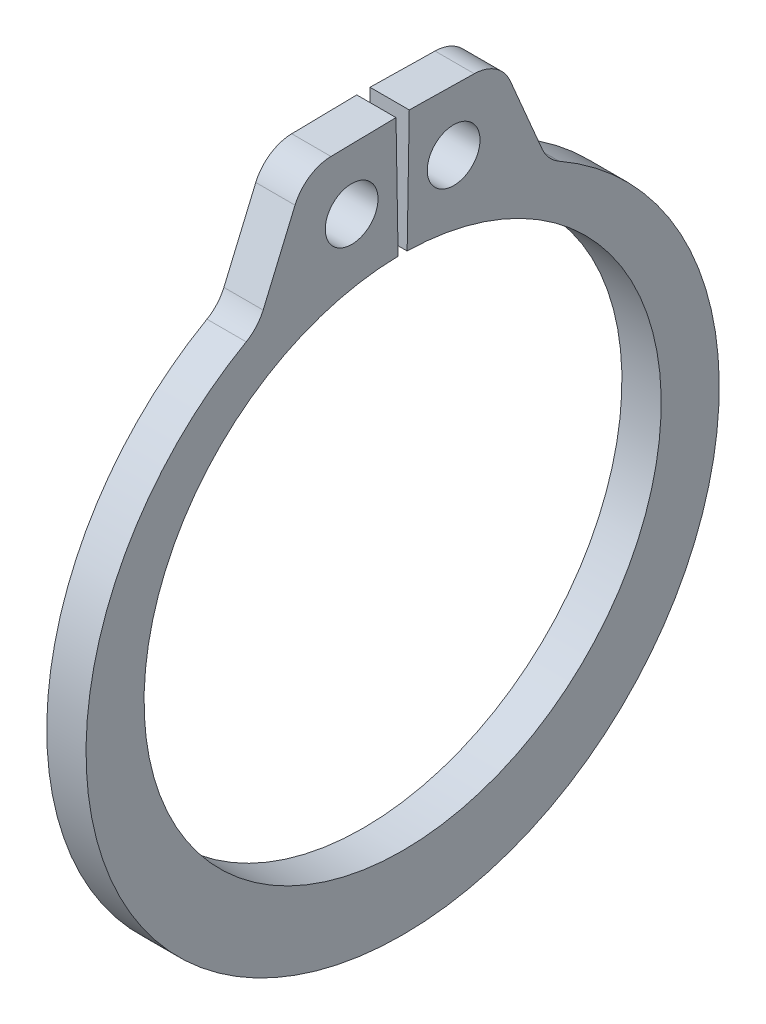
ISO-10303-21;
HEADER;
FILE_DESCRIPTION(('STEP AP214'),'2;1');
FILE_NAME('part.step','',(''),(''),'','','');
FILE_SCHEMA(('AUTOMOTIVE_DESIGN { 1 0 10303 214 1 1 1 1 }'));
ENDSEC;
DATA;
#1=APPLICATION_CONTEXT('core data for automotive mechanical design processes');
#2=APPLICATION_PROTOCOL_DEFINITION('international standard','automotive_design',2000,#1);
#3=PRODUCT_CONTEXT('',#1,'mechanical');
#4=PRODUCT('Part','Part','',(#3));
#5=PRODUCT_RELATED_PRODUCT_CATEGORY('part','',(#4));
#6=PRODUCT_DEFINITION_FORMATION('','',#4);
#7=PRODUCT_DEFINITION_CONTEXT('part definition',#1,'design');
#8=PRODUCT_DEFINITION('design','',#6,#7);
#9=PRODUCT_DEFINITION_SHAPE('','',#8);
#10=(LENGTH_UNIT() NAMED_UNIT(*) SI_UNIT(.MILLI.,.METRE.));
#11=(NAMED_UNIT(*) PLANE_ANGLE_UNIT() SI_UNIT($,.RADIAN.));
#12=(NAMED_UNIT(*) SI_UNIT($,.STERADIAN.) SOLID_ANGLE_UNIT());
#13=UNCERTAINTY_MEASURE_WITH_UNIT(LENGTH_MEASURE(1.E-05),#10,'distance_accuracy_value','');
#14=(GEOMETRIC_REPRESENTATION_CONTEXT(3) GLOBAL_UNCERTAINTY_ASSIGNED_CONTEXT((#13)) GLOBAL_UNIT_ASSIGNED_CONTEXT((#10,
#11,#12)) REPRESENTATION_CONTEXT('',''));
#15=CARTESIAN_POINT('',(0.,0.,0.));
#16=DIRECTION('',(0.,0.,1.));
#17=DIRECTION('',(1.,0.,0.));
#18=AXIS2_PLACEMENT_3D('',#15,#16,#17);
#19=CARTESIAN_POINT('',(0.4445,0.,0.));
#20=DIRECTION('',(1.,0.,0.));
#21=DIRECTION('',(0.,0.,-1.));
#22=AXIS2_PLACEMENT_3D('',#19,#20,#21);
#23=PLANE('',#22);
#24=CARTESIAN_POINT('',(0.4445,7.20724610900658,1.15465964864513));
#25=DIRECTION('',(1.,0.,0.));
#26=DIRECTION('',(0.,0.,-1.));
#27=AXIS2_PLACEMENT_3D('',#24,#25,#26);
#28=CIRCLE('',#27,0.5969);
#29=CARTESIAN_POINT('',(0.4445,7.20724610900658,0.557759648645128));
#30=VERTEX_POINT('',#29);
#31=EDGE_CURVE('E172',#30,#30,#28,.T.);
#32=ORIENTED_EDGE('',*,*,#31,.F.);
#33=EDGE_LOOP('',(#32));
#34=FACE_BOUND('',#33,.T.);
#35=DIRECTION('',(0.,-0.01745240643729,0.999847695156391));
#36=VECTOR('',#35,1.);
#37=CARTESIAN_POINT('',(0.4445,8.59659049818515,0.15005404530712));
#38=LINE('',#37,#36);
#39=CARTESIAN_POINT('',(0.4445,8.59659049818515,0.15005404530712));
#40=VERTEX_POINT('',#39);
#41=CARTESIAN_POINT('',(0.4445,8.5708933863481,1.62224059647238));
#42=VERTEX_POINT('',#41);
#43=EDGE_CURVE('E203',#40,#42,#38,.T.);
#44=ORIENTED_EDGE('',*,*,#43,.T.);
#45=CARTESIAN_POINT('',(0.4445,7.66933071962558,1.60650376158788));
#46=DIRECTION('',(1.,0.,0.));
#47=DIRECTION('',(0.,0.,-1.));
#48=AXIS2_PLACEMENT_3D('',#45,#46,#47);
#49=CIRCLE('',#48,0.9017);
#50=CARTESIAN_POINT('',(0.4445,8.02240621636442,2.43620285379096));
#51=VERTEX_POINT('',#50);
#52=EDGE_CURVE('E250',#42,#51,#49,.T.);
#53=ORIENTED_EDGE('',*,*,#52,.T.);
#54=DIRECTION('',(0.,-0.920149819455566,0.391566481910656));
#55=VECTOR('',#54,1.);
#56=CARTESIAN_POINT('',(0.4445,8.56068391718107,2.20714069332188));
#57=LINE('',#56,#55);
#58=CARTESIAN_POINT('',(0.4445,6.32616456625773,3.15803245301383));
#59=VERTEX_POINT('',#58);
#60=EDGE_CURVE('E205',#51,#59,#57,.T.);
#61=ORIENTED_EDGE('',*,*,#60,.T.);
#62=CARTESIAN_POINT('',(0.4445,6.67924006299657,3.98773154521692));
#63=DIRECTION('',(1.,0.,0.));
#64=DIRECTION('',(0.,0.,-1.));
#65=AXIS2_PLACEMENT_3D('',#62,#63,#64);
#66=CIRCLE('',#65,0.9017);
#67=CARTESIAN_POINT('',(0.4445,5.89530863003733,3.54218199868087));
#68=VERTEX_POINT('',#67);
#69=EDGE_CURVE('E258',#59,#68,#66,.F.);
#70=ORIENTED_EDGE('',*,*,#69,.T.);
#71=CARTESIAN_POINT('',(0.4445,-0.337057291142251,0.));
#72=DIRECTION('',(1.,0.,0.));
#73=DIRECTION('',(0.,0.,-1.));
#74=AXIS2_PLACEMENT_3D('',#71,#72,#73);
#75=CIRCLE('',#74,7.16864270885775);
#76=CARTESIAN_POINT('',(0.4445,5.89530863003733,-3.54218199868087));
#77=VERTEX_POINT('',#76);
#78=EDGE_CURVE('E209',#68,#77,#75,.T.);
#79=ORIENTED_EDGE('',*,*,#78,.T.);
#80=CARTESIAN_POINT('',(0.4445,6.67924006299657,-3.98773154521692));
#81=DIRECTION('',(1.,0.,0.));
#82=DIRECTION('',(0.,0.,-1.));
#83=AXIS2_PLACEMENT_3D('',#80,#81,#82);
#84=CIRCLE('',#83,0.9017);
#85=CARTESIAN_POINT('',(0.4445,6.32616456625773,-3.15803245301383));
#86=VERTEX_POINT('',#85);
#87=EDGE_CURVE('E11',#77,#86,#84,.F.);
#88=ORIENTED_EDGE('',*,*,#87,.T.);
#89=DIRECTION('',(0.,0.920149819455566,0.391566481910656));
#90=VECTOR('',#89,1.);
#91=CARTESIAN_POINT('',(0.4445,8.56068391718107,-2.20714069332188));
#92=LINE('',#91,#90);
#93=CARTESIAN_POINT('',(0.4445,8.02240621636442,-2.43620285379096));
#94=VERTEX_POINT('',#93);
#95=EDGE_CURVE('E212',#86,#94,#92,.T.);
#96=ORIENTED_EDGE('',*,*,#95,.T.);
#97=CARTESIAN_POINT('',(0.4445,7.66933071962558,-1.60650376158788));
#98=DIRECTION('',(1.,0.,0.));
#99=DIRECTION('',(0.,0.,-1.));
#100=AXIS2_PLACEMENT_3D('',#97,#98,#99);
#101=CIRCLE('',#100,0.9017);
#102=CARTESIAN_POINT('',(0.4445,8.5708933863481,-1.62224059647238));
#103=VERTEX_POINT('',#102);
#104=EDGE_CURVE('E56',#94,#103,#101,.T.);
#105=ORIENTED_EDGE('',*,*,#104,.T.);
#106=DIRECTION('',(0.,0.01745240643729,0.999847695156391));
#107=VECTOR('',#106,1.);
#108=CARTESIAN_POINT('',(0.4445,8.59659049818515,-0.15005404530712));
#109=LINE('',#108,#107);
#110=CARTESIAN_POINT('',(0.4445,8.59659049818515,-0.15005404530712));
#111=VERTEX_POINT('',#110);
#112=EDGE_CURVE('E215',#103,#111,#109,.T.);
#113=ORIENTED_EDGE('',*,*,#112,.T.);
#114=DIRECTION('',(0.,-0.999847695156391,0.0174524064372833));
#115=VECTOR('',#114,1.);
#116=CARTESIAN_POINT('',(0.4445,5.85380830083213,-0.102178603968365));
#117=LINE('',#116,#115);
#118=CARTESIAN_POINT('',(0.4445,5.85380830083213,-0.102178603968365));
#119=VERTEX_POINT('',#118);
#120=EDGE_CURVE('E217',#111,#119,#117,.T.);
#121=ORIENTED_EDGE('',*,*,#120,.T.);
#122=CARTESIAN_POINT('',(0.4445,0.,0.));
#123=DIRECTION('',(-1.,0.,0.));
#124=DIRECTION('',(0.,0.,-1.));
#125=AXIS2_PLACEMENT_3D('',#122,#123,#124);
#126=CIRCLE('',#125,5.8547);
#127=CARTESIAN_POINT('',(0.4445,5.85380830083213,0.102178603968365));
#128=VERTEX_POINT('',#127);
#129=EDGE_CURVE('E198',#119,#128,#126,.T.);
#130=ORIENTED_EDGE('',*,*,#129,.T.);
#131=DIRECTION('',(0.,0.999847695156391,0.0174524064372833));
#132=VECTOR('',#131,1.);
#133=CARTESIAN_POINT('',(0.4445,5.85380830083213,0.102178603968365));
#134=LINE('',#133,#132);
#135=EDGE_CURVE('E160',#128,#40,#134,.T.);
#136=ORIENTED_EDGE('',*,*,#135,.T.);
#137=EDGE_LOOP('',(#44,#53,#61,#70,#79,#88,#96,#105,#113,#121,#130,#136));
#138=FACE_BOUND('',#137,.T.);
#139=CARTESIAN_POINT('',(0.4445,7.20724610900658,-1.15465964864513));
#140=DIRECTION('',(1.,0.,0.));
#141=DIRECTION('',(0.,0.,-1.));
#142=AXIS2_PLACEMENT_3D('',#139,#140,#141);
#143=CIRCLE('',#142,0.5969);
#144=CARTESIAN_POINT('',(0.4445,7.20724610900658,-1.75155964864513));
#145=VERTEX_POINT('',#144);
#146=EDGE_CURVE('E435',#145,#145,#143,.T.);
#147=ORIENTED_EDGE('',*,*,#146,.F.);
#148=EDGE_LOOP('',(#147));
#149=FACE_BOUND('',#148,.T.);
#150=ADVANCED_FACE('F40',(#34,#138,#149),#23,.T.);
#151=CARTESIAN_POINT('',(-0.4445,0.,0.));
#152=DIRECTION('',(1.,0.,0.));
#153=DIRECTION('',(0.,0.,-1.));
#154=AXIS2_PLACEMENT_3D('',#151,#152,#153);
#155=PLANE('',#154);
#156=CARTESIAN_POINT('',(-0.4445,7.20724610900658,1.15465964864513));
#157=DIRECTION('',(1.,0.,0.));
#158=DIRECTION('',(0.,0.,-1.));
#159=AXIS2_PLACEMENT_3D('',#156,#157,#158);
#160=CIRCLE('',#159,0.5969);
#161=CARTESIAN_POINT('',(-0.4445,7.20724610900658,0.557759648645128));
#162=VERTEX_POINT('',#161);
#163=EDGE_CURVE('E178',#162,#162,#160,.T.);
#164=ORIENTED_EDGE('',*,*,#163,.T.);
#165=EDGE_LOOP('',(#164));
#166=FACE_BOUND('',#165,.T.);
#167=DIRECTION('',(0.,-0.920149819455566,0.391566481910656));
#168=VECTOR('',#167,1.);
#169=CARTESIAN_POINT('',(-0.4445,8.56068391718107,2.20714069332188));
#170=LINE('',#169,#168);
#171=CARTESIAN_POINT('',(-0.4445,8.02240621636442,2.43620285379096));
#172=VERTEX_POINT('',#171);
#173=CARTESIAN_POINT('',(-0.4445,6.32616456625773,3.15803245301383));
#174=VERTEX_POINT('',#173);
#175=EDGE_CURVE('E183',#172,#174,#170,.T.);
#176=ORIENTED_EDGE('',*,*,#175,.F.);
#177=CARTESIAN_POINT('',(-0.4445,7.66933071962558,1.60650376158788));
#178=DIRECTION('',(1.,0.,0.));
#179=DIRECTION('',(0.,0.,-1.));
#180=AXIS2_PLACEMENT_3D('',#177,#178,#179);
#181=CIRCLE('',#180,0.9017);
#182=CARTESIAN_POINT('',(-0.4445,8.5708933863481,1.62224059647238));
#183=VERTEX_POINT('',#182);
#184=EDGE_CURVE('E246',#172,#183,#181,.F.);
#185=ORIENTED_EDGE('',*,*,#184,.T.);
#186=DIRECTION('',(0.,-0.01745240643729,0.999847695156391));
#187=VECTOR('',#186,1.);
#188=CARTESIAN_POINT('',(-0.4445,8.59659049818515,0.15005404530712));
#189=LINE('',#188,#187);
#190=CARTESIAN_POINT('',(-0.4445,8.59659049818515,0.15005404530712));
#191=VERTEX_POINT('',#190);
#192=EDGE_CURVE('E151',#191,#183,#189,.T.);
#193=ORIENTED_EDGE('',*,*,#192,.F.);
#194=DIRECTION('',(0.,0.999847695156391,0.0174524064372833));
#195=VECTOR('',#194,1.);
#196=CARTESIAN_POINT('',(-0.4445,5.85380830083213,0.102178603968365));
#197=LINE('',#196,#195);
#198=CARTESIAN_POINT('',(-0.4445,5.85380830083213,0.102178603968365));
#199=VERTEX_POINT('',#198);
#200=EDGE_CURVE('E143',#199,#191,#197,.T.);
#201=ORIENTED_EDGE('',*,*,#200,.F.);
#202=CARTESIAN_POINT('',(-0.4445,0.,0.));
#203=DIRECTION('',(-1.,0.,0.));
#204=DIRECTION('',(0.,0.,-1.));
#205=AXIS2_PLACEMENT_3D('',#202,#203,#204);
#206=CIRCLE('',#205,5.8547);
#207=CARTESIAN_POINT('',(-0.4445,5.85380830083213,-0.102178603968365));
#208=VERTEX_POINT('',#207);
#209=EDGE_CURVE('E150',#208,#199,#206,.T.);
#210=ORIENTED_EDGE('',*,*,#209,.F.);
#211=DIRECTION('',(0.,-0.999847695156391,0.0174524064372833));
#212=VECTOR('',#211,1.);
#213=CARTESIAN_POINT('',(-0.4445,5.85380830083213,-0.102178603968365));
#214=LINE('',#213,#212);
#215=CARTESIAN_POINT('',(-0.4445,8.59659049818515,-0.15005404530712));
#216=VERTEX_POINT('',#215);
#217=EDGE_CURVE('E195',#216,#208,#214,.T.);
#218=ORIENTED_EDGE('',*,*,#217,.F.);
#219=DIRECTION('',(0.,0.01745240643729,0.999847695156391));
#220=VECTOR('',#219,1.);
#221=CARTESIAN_POINT('',(-0.4445,8.59659049818515,-0.15005404530712));
#222=LINE('',#221,#220);
#223=CARTESIAN_POINT('',(-0.4445,8.5708933863481,-1.62224059647238));
#224=VERTEX_POINT('',#223);
#225=EDGE_CURVE('E193',#224,#216,#222,.T.);
#226=ORIENTED_EDGE('',*,*,#225,.F.);
#227=CARTESIAN_POINT('',(-0.4445,7.66933071962558,-1.60650376158788));
#228=DIRECTION('',(1.,0.,0.));
#229=DIRECTION('',(0.,0.,-1.));
#230=AXIS2_PLACEMENT_3D('',#227,#228,#229);
#231=CIRCLE('',#230,0.9017);
#232=CARTESIAN_POINT('',(-0.4445,8.02240621636442,-2.43620285379096));
#233=VERTEX_POINT('',#232);
#234=EDGE_CURVE('E244',#224,#233,#231,.F.);
#235=ORIENTED_EDGE('',*,*,#234,.T.);
#236=DIRECTION('',(0.,0.920149819455566,0.391566481910656));
#237=VECTOR('',#236,1.);
#238=CARTESIAN_POINT('',(-0.4445,8.56068391718107,-2.20714069332188));
#239=LINE('',#238,#237);
#240=CARTESIAN_POINT('',(-0.4445,6.32616456625773,-3.15803245301383));
#241=VERTEX_POINT('',#240);
#242=EDGE_CURVE('E190',#241,#233,#239,.T.);
#243=ORIENTED_EDGE('',*,*,#242,.F.);
#244=CARTESIAN_POINT('',(-0.4445,6.67924006299657,-3.98773154521692));
#245=DIRECTION('',(1.,0.,0.));
#246=DIRECTION('',(0.,0.,-1.));
#247=AXIS2_PLACEMENT_3D('',#244,#245,#246);
#248=CIRCLE('',#247,0.9017);
#249=CARTESIAN_POINT('',(-0.4445,5.89530863003733,-3.54218199868087));
#250=VERTEX_POINT('',#249);
#251=EDGE_CURVE('E49',#241,#250,#248,.T.);
#252=ORIENTED_EDGE('',*,*,#251,.T.);
#253=CARTESIAN_POINT('',(-0.4445,-0.337057291142251,0.));
#254=DIRECTION('',(1.,0.,0.));
#255=DIRECTION('',(0.,0.,-1.));
#256=AXIS2_PLACEMENT_3D('',#253,#254,#255);
#257=CIRCLE('',#256,7.16864270885775);
#258=CARTESIAN_POINT('',(-0.4445,5.89530863003733,3.54218199868087));
#259=VERTEX_POINT('',#258);
#260=EDGE_CURVE('E187',#259,#250,#257,.T.);
#261=ORIENTED_EDGE('',*,*,#260,.F.);
#262=CARTESIAN_POINT('',(-0.4445,6.67924006299657,3.98773154521692));
#263=DIRECTION('',(1.,0.,0.));
#264=DIRECTION('',(0.,0.,-1.));
#265=AXIS2_PLACEMENT_3D('',#262,#263,#264);
#266=CIRCLE('',#265,0.9017);
#267=EDGE_CURVE('E255',#259,#174,#266,.T.);
#268=ORIENTED_EDGE('',*,*,#267,.T.);
#269=EDGE_LOOP('',(#176,#185,#193,#201,#210,#218,#226,#235,#243,#252,#261,#268));
#270=FACE_BOUND('',#269,.T.);
#271=CARTESIAN_POINT('',(-0.4445,7.20724610900658,-1.15465964864513));
#272=DIRECTION('',(1.,0.,0.));
#273=DIRECTION('',(0.,0.,-1.));
#274=AXIS2_PLACEMENT_3D('',#271,#272,#273);
#275=CIRCLE('',#274,0.5969);
#276=CARTESIAN_POINT('',(-0.4445,7.20724610900658,-1.75155964864513));
#277=VERTEX_POINT('',#276);
#278=EDGE_CURVE('E438',#277,#277,#275,.T.);
#279=ORIENTED_EDGE('',*,*,#278,.T.);
#280=EDGE_LOOP('',(#279));
#281=FACE_BOUND('',#280,.T.);
#282=ADVANCED_FACE('F146',(#166,#270,#281),#155,.F.);
#283=CARTESIAN_POINT('',(0.4445,0.,0.));
#284=DIRECTION('',(-1.,0.,0.));
#285=DIRECTION('',(0.,0.,1.));
#286=AXIS2_PLACEMENT_3D('',#283,#284,#285);
#287=CYLINDRICAL_SURFACE('',#286,5.8547);
#288=ORIENTED_EDGE('',*,*,#209,.T.);
#289=DIRECTION('',(-1.,0.,0.));
#290=VECTOR('',#289,1.);
#291=CARTESIAN_POINT('',(0.4445,5.85380830083213,0.102178603968365));
#292=LINE('',#291,#290);
#293=EDGE_CURVE('E158',#128,#199,#292,.T.);
#294=ORIENTED_EDGE('',*,*,#293,.F.);
#295=ORIENTED_EDGE('',*,*,#129,.F.);
#296=DIRECTION('',(-1.,0.,0.));
#297=VECTOR('',#296,1.);
#298=CARTESIAN_POINT('',(0.4445,5.85380830083213,-0.102178603968365));
#299=LINE('',#298,#297);
#300=EDGE_CURVE('E170',#119,#208,#299,.T.);
#301=ORIENTED_EDGE('',*,*,#300,.T.);
#302=EDGE_LOOP('',(#288,#294,#295,#301));
#303=FACE_BOUND('',#302,.T.);
#304=ADVANCED_FACE('F42',(#303),#287,.F.);
#305=CARTESIAN_POINT('',(0.4445,5.85380830083213,0.102178603968365));
#306=DIRECTION('',(0.,-0.0174524064372833,0.999847695156391));
#307=DIRECTION('',(0.,-0.999847695156391,-0.0174524064372833));
#308=AXIS2_PLACEMENT_3D('',#305,#306,#307);
#309=PLANE('',#308);
#310=ORIENTED_EDGE('',*,*,#200,.T.);
#311=DIRECTION('',(-1.,0.,0.));
#312=VECTOR('',#311,1.);
#313=CARTESIAN_POINT('',(0.4445,8.59659049818515,0.15005404530712));
#314=LINE('',#313,#312);
#315=EDGE_CURVE('E166',#40,#191,#314,.T.);
#316=ORIENTED_EDGE('',*,*,#315,.F.);
#317=ORIENTED_EDGE('',*,*,#135,.F.);
#318=ORIENTED_EDGE('',*,*,#293,.T.);
#319=EDGE_LOOP('',(#310,#316,#317,#318));
#320=FACE_BOUND('',#319,.T.);
#321=ADVANCED_FACE('F159',(#320),#309,.F.);
#322=CARTESIAN_POINT('',(0.4445,8.59659049818515,0.15005404530712));
#323=DIRECTION('',(0.,-0.999847695156391,-0.01745240643729));
#324=DIRECTION('',(0.,0.01745240643729,-0.999847695156391));
#325=AXIS2_PLACEMENT_3D('',#322,#323,#324);
#326=PLANE('',#325);
#327=ORIENTED_EDGE('',*,*,#192,.T.);
#328=DIRECTION('',(-1.,0.,0.));
#329=VECTOR('',#328,1.);
#330=CARTESIAN_POINT('',(0.4445,8.5708933863481,1.62224059647238));
#331=LINE('',#330,#329);
#332=EDGE_CURVE('E64',#183,#42,#331,.F.);
#333=ORIENTED_EDGE('',*,*,#332,.T.);
#334=ORIENTED_EDGE('',*,*,#43,.F.);
#335=ORIENTED_EDGE('',*,*,#315,.T.);
#336=EDGE_LOOP('',(#327,#333,#334,#335));
#337=FACE_BOUND('',#336,.T.);
#338=ADVANCED_FACE('F288',(#337),#326,.F.);
#339=CARTESIAN_POINT('',(0.4445,8.56068391718107,2.20714069332188));
#340=DIRECTION('',(0.,-0.391566481910657,-0.920149819455567));
#341=DIRECTION('',(0.,0.920149819455567,-0.391566481910657));
#342=AXIS2_PLACEMENT_3D('',#339,#340,#341);
#343=PLANE('',#342);
#344=ORIENTED_EDGE('',*,*,#175,.T.);
#345=DIRECTION('',(1.,0.,0.));
#346=VECTOR('',#345,1.);
#347=CARTESIAN_POINT('',(0.4445,6.32616456625773,3.15803245301383));
#348=LINE('',#347,#346);
#349=EDGE_CURVE('E235',#174,#59,#348,.T.);
#350=ORIENTED_EDGE('',*,*,#349,.T.);
#351=ORIENTED_EDGE('',*,*,#60,.F.);
#352=DIRECTION('',(-1.,0.,0.));
#353=VECTOR('',#352,1.);
#354=CARTESIAN_POINT('',(0.4445,8.02240621636442,2.43620285379096));
#355=LINE('',#354,#353);
#356=EDGE_CURVE('E232',#51,#172,#355,.T.);
#357=ORIENTED_EDGE('',*,*,#356,.T.);
#358=EDGE_LOOP('',(#344,#350,#351,#357));
#359=FACE_BOUND('',#358,.T.);
#360=ADVANCED_FACE('F290',(#359),#343,.F.);
#361=CARTESIAN_POINT('',(0.4445,-0.337057291142251,0.));
#362=DIRECTION('',(-1.,0.,0.));
#363=DIRECTION('',(0.,0.,1.));
#364=AXIS2_PLACEMENT_3D('',#361,#362,#363);
#365=CYLINDRICAL_SURFACE('',#364,7.16864270885775);
#366=ORIENTED_EDGE('',*,*,#78,.F.);
#367=DIRECTION('',(-1.,0.,0.));
#368=VECTOR('',#367,1.);
#369=CARTESIAN_POINT('',(0.4445,5.89530863003733,3.54218199868087));
#370=LINE('',#369,#368);
#371=EDGE_CURVE('E228',#68,#259,#370,.T.);
#372=ORIENTED_EDGE('',*,*,#371,.T.);
#373=ORIENTED_EDGE('',*,*,#260,.T.);
#374=DIRECTION('',(-1.,0.,0.));
#375=VECTOR('',#374,1.);
#376=CARTESIAN_POINT('',(0.4445,5.89530863003733,-3.54218199868087));
#377=LINE('',#376,#375);
#378=EDGE_CURVE('E165',#250,#77,#377,.F.);
#379=ORIENTED_EDGE('',*,*,#378,.T.);
#380=EDGE_LOOP('',(#366,#372,#373,#379));
#381=FACE_BOUND('',#380,.T.);
#382=ADVANCED_FACE('F268',(#381),#365,.T.);
#383=CARTESIAN_POINT('',(0.4445,8.56068391718107,-2.20714069332188));
#384=DIRECTION('',(0.,-0.391566481910657,0.920149819455567));
#385=DIRECTION('',(0.,-0.920149819455567,-0.391566481910657));
#386=AXIS2_PLACEMENT_3D('',#383,#384,#385);
#387=PLANE('',#386);
#388=ORIENTED_EDGE('',*,*,#95,.F.);
#389=DIRECTION('',(1.,0.,0.));
#390=VECTOR('',#389,1.);
#391=CARTESIAN_POINT('',(-0.4445,6.32616456625773,-3.15803245301383));
#392=LINE('',#391,#390);
#393=EDGE_CURVE('E240',#86,#241,#392,.F.);
#394=ORIENTED_EDGE('',*,*,#393,.T.);
#395=ORIENTED_EDGE('',*,*,#242,.T.);
#396=DIRECTION('',(-1.,0.,0.));
#397=VECTOR('',#396,1.);
#398=CARTESIAN_POINT('',(0.4445,8.02240621636442,-2.43620285379096));
#399=LINE('',#398,#397);
#400=EDGE_CURVE('E238',#233,#94,#399,.F.);
#401=ORIENTED_EDGE('',*,*,#400,.T.);
#402=EDGE_LOOP('',(#388,#394,#395,#401));
#403=FACE_BOUND('',#402,.T.);
#404=ADVANCED_FACE('F275',(#403),#387,.F.);
#405=CARTESIAN_POINT('',(0.4445,8.59659049818515,-0.15005404530712));
#406=DIRECTION('',(0.,-0.999847695156391,0.01745240643729));
#407=DIRECTION('',(0.,-0.01745240643729,-0.999847695156391));
#408=AXIS2_PLACEMENT_3D('',#405,#406,#407);
#409=PLANE('',#408);
#410=ORIENTED_EDGE('',*,*,#112,.F.);
#411=DIRECTION('',(-1.,0.,0.));
#412=VECTOR('',#411,1.);
#413=CARTESIAN_POINT('',(0.4445,8.5708933863481,-1.62224059647238));
#414=LINE('',#413,#412);
#415=EDGE_CURVE('E252',#103,#224,#414,.T.);
#416=ORIENTED_EDGE('',*,*,#415,.T.);
#417=ORIENTED_EDGE('',*,*,#225,.T.);
#418=DIRECTION('',(-1.,0.,0.));
#419=VECTOR('',#418,1.);
#420=CARTESIAN_POINT('',(0.4445,8.59659049818515,-0.15005404530712));
#421=LINE('',#420,#419);
#422=EDGE_CURVE('E222',#111,#216,#421,.T.);
#423=ORIENTED_EDGE('',*,*,#422,.F.);
#424=EDGE_LOOP('',(#410,#416,#417,#423));
#425=FACE_BOUND('',#424,.T.);
#426=ADVANCED_FACE('F282',(#425),#409,.F.);
#427=CARTESIAN_POINT('',(0.4445,5.85380830083213,-0.102178603968365));
#428=DIRECTION('',(0.,-0.0174524064372833,-0.999847695156391));
#429=DIRECTION('',(0.,0.999847695156391,-0.0174524064372833));
#430=AXIS2_PLACEMENT_3D('',#427,#428,#429);
#431=PLANE('',#430);
#432=ORIENTED_EDGE('',*,*,#217,.T.);
#433=ORIENTED_EDGE('',*,*,#300,.F.);
#434=ORIENTED_EDGE('',*,*,#120,.F.);
#435=ORIENTED_EDGE('',*,*,#422,.T.);
#436=EDGE_LOOP('',(#432,#433,#434,#435));
#437=FACE_BOUND('',#436,.T.);
#438=ADVANCED_FACE('F285',(#437),#431,.F.);
#439=CARTESIAN_POINT('',(0.4445,7.20724610900658,1.15465964864513));
#440=DIRECTION('',(-1.,0.,0.));
#441=DIRECTION('',(0.,0.,1.));
#442=AXIS2_PLACEMENT_3D('',#439,#440,#441);
#443=CYLINDRICAL_SURFACE('',#442,0.5969);
#444=ORIENTED_EDGE('',*,*,#31,.T.);
#445=EDGE_LOOP('',(#444));
#446=FACE_BOUND('',#445,.T.);
#447=ORIENTED_EDGE('',*,*,#163,.F.);
#448=EDGE_LOOP('',(#447));
#449=FACE_BOUND('',#448,.T.);
#450=ADVANCED_FACE('F311',(#446,#449),#443,.F.);
#451=CARTESIAN_POINT('',(0.4445,7.20724610900658,-1.15465964864513));
#452=DIRECTION('',(-1.,0.,0.));
#453=DIRECTION('',(0.,0.,1.));
#454=AXIS2_PLACEMENT_3D('',#451,#452,#453);
#455=CYLINDRICAL_SURFACE('',#454,0.5969);
#456=ORIENTED_EDGE('',*,*,#146,.T.);
#457=EDGE_LOOP('',(#456));
#458=FACE_BOUND('',#457,.T.);
#459=ORIENTED_EDGE('',*,*,#278,.F.);
#460=EDGE_LOOP('',(#459));
#461=FACE_BOUND('',#460,.T.);
#462=ADVANCED_FACE('F341',(#458,#461),#455,.F.);
#463=CARTESIAN_POINT('',(0.4445,6.67924006299657,3.98773154521692));
#464=DIRECTION('',(-1.,0.,0.));
#465=DIRECTION('',(0.,0.,1.));
#466=AXIS2_PLACEMENT_3D('',#463,#464,#465);
#467=CYLINDRICAL_SURFACE('',#466,0.9017);
#468=ORIENTED_EDGE('',*,*,#69,.F.);
#469=ORIENTED_EDGE('',*,*,#349,.F.);
#470=ORIENTED_EDGE('',*,*,#267,.F.);
#471=ORIENTED_EDGE('',*,*,#371,.F.);
#472=EDGE_LOOP('',(#468,#469,#470,#471));
#473=FACE_BOUND('',#472,.T.);
#474=ADVANCED_FACE('F348',(#473),#467,.F.);
#475=CARTESIAN_POINT('',(0.4445,6.67924006299657,-3.98773154521692));
#476=DIRECTION('',(-1.,0.,0.));
#477=DIRECTION('',(0.,0.,1.));
#478=AXIS2_PLACEMENT_3D('',#475,#476,#477);
#479=CYLINDRICAL_SURFACE('',#478,0.9017);
#480=ORIENTED_EDGE('',*,*,#87,.F.);
#481=ORIENTED_EDGE('',*,*,#378,.F.);
#482=ORIENTED_EDGE('',*,*,#251,.F.);
#483=ORIENTED_EDGE('',*,*,#393,.F.);
#484=EDGE_LOOP('',(#480,#481,#482,#483));
#485=FACE_BOUND('',#484,.T.);
#486=ADVANCED_FACE('F271',(#485),#479,.F.);
#487=CARTESIAN_POINT('',(0.4445,7.66933071962558,1.60650376158788));
#488=DIRECTION('',(-1.,0.,0.));
#489=DIRECTION('',(0.,0.,1.));
#490=AXIS2_PLACEMENT_3D('',#487,#488,#489);
#491=CYLINDRICAL_SURFACE('',#490,0.9017);
#492=ORIENTED_EDGE('',*,*,#52,.F.);
#493=ORIENTED_EDGE('',*,*,#332,.F.);
#494=ORIENTED_EDGE('',*,*,#184,.F.);
#495=ORIENTED_EDGE('',*,*,#356,.F.);
#496=EDGE_LOOP('',(#492,#493,#494,#495));
#497=FACE_BOUND('',#496,.T.);
#498=ADVANCED_FACE('F362',(#497),#491,.T.);
#499=CARTESIAN_POINT('',(0.4445,7.66933071962558,-1.60650376158788));
#500=DIRECTION('',(-1.,0.,0.));
#501=DIRECTION('',(0.,0.,1.));
#502=AXIS2_PLACEMENT_3D('',#499,#500,#501);
#503=CYLINDRICAL_SURFACE('',#502,0.9017);
#504=ORIENTED_EDGE('',*,*,#104,.F.);
#505=ORIENTED_EDGE('',*,*,#400,.F.);
#506=ORIENTED_EDGE('',*,*,#234,.F.);
#507=ORIENTED_EDGE('',*,*,#415,.F.);
#508=EDGE_LOOP('',(#504,#505,#506,#507));
#509=FACE_BOUND('',#508,.T.);
#510=ADVANCED_FACE('F278',(#509),#503,.T.);
#511=CLOSED_SHELL('',(#150,#282,#304,#321,#338,#360,#382,#404,#426,#438,#450,#462,#474,#486,
#498,#510));
#512=MANIFOLD_SOLID_BREP('B2',#511);
#513=ADVANCED_BREP_SHAPE_REPRESENTATION('',(#18,#512),#14);
#514=SHAPE_DEFINITION_REPRESENTATION(#9,#513);
ENDSEC;
END-ISO-10303-21;
